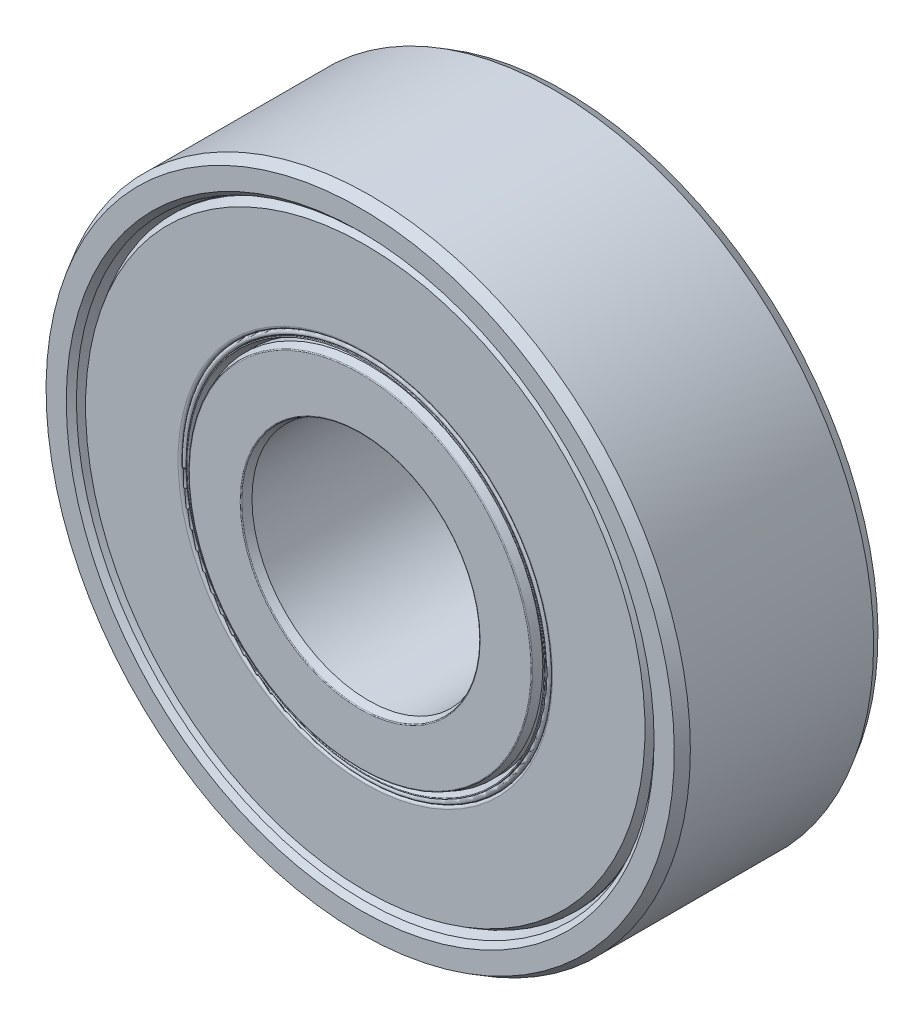
ISO-10303-21;
HEADER;
FILE_DESCRIPTION(('STEP AP214'),'2;1');
FILE_NAME('part.step','',(''),(''),'','','');
FILE_SCHEMA(('AUTOMOTIVE_DESIGN { 1 0 10303 214 1 1 1 1 }'));
ENDSEC;
DATA;
#1=APPLICATION_CONTEXT('core data for automotive mechanical design processes');
#2=APPLICATION_PROTOCOL_DEFINITION('international standard','automotive_design',2000,#1);
#3=PRODUCT_CONTEXT('',#1,'mechanical');
#4=PRODUCT('Part','Part','',(#3));
#5=PRODUCT_RELATED_PRODUCT_CATEGORY('part','',(#4));
#6=PRODUCT_DEFINITION_FORMATION('','',#4);
#7=PRODUCT_DEFINITION_CONTEXT('part definition',#1,'design');
#8=PRODUCT_DEFINITION('design','',#6,#7);
#9=PRODUCT_DEFINITION_SHAPE('','',#8);
#10=(LENGTH_UNIT() NAMED_UNIT(*) SI_UNIT(.MILLI.,.METRE.));
#11=(NAMED_UNIT(*) PLANE_ANGLE_UNIT() SI_UNIT($,.RADIAN.));
#12=(NAMED_UNIT(*) SI_UNIT($,.STERADIAN.) SOLID_ANGLE_UNIT());
#13=UNCERTAINTY_MEASURE_WITH_UNIT(LENGTH_MEASURE(1.E-05),#10,'distance_accuracy_value','');
#14=(GEOMETRIC_REPRESENTATION_CONTEXT(3) GLOBAL_UNCERTAINTY_ASSIGNED_CONTEXT((#13)) GLOBAL_UNIT_ASSIGNED_CONTEXT((#10,
#11,#12)) REPRESENTATION_CONTEXT('',''));
#15=CARTESIAN_POINT('',(0.,0.,0.));
#16=DIRECTION('',(0.,0.,1.));
#17=DIRECTION('',(1.,0.,0.));
#18=AXIS2_PLACEMENT_3D('',#15,#16,#17);
#19=CARTESIAN_POINT('',(0.,0.,3.5));
#20=DIRECTION('',(0.,0.,1.));
#21=DIRECTION('',(0.,-1.,0.));
#22=AXIS2_PLACEMENT_3D('',#19,#20,#21);
#23=CYLINDRICAL_SURFACE('',#22,6.34803966942149);
#24=CARTESIAN_POINT('',(0.,0.,-2.50098016528926));
#25=DIRECTION('',(0.,0.,1.));
#26=DIRECTION('',(0.,-1.,0.));
#27=AXIS2_PLACEMENT_3D('',#24,#25,#26);
#28=CIRCLE('',#27,6.34803966942149);
#29=CARTESIAN_POINT('',(0.,-6.34803966942148,-2.50098016528926));
#30=VERTEX_POINT('',#29);
#31=EDGE_CURVE('E11',#30,#30,#28,.T.);
#32=ORIENTED_EDGE('',*,*,#31,.F.);
#33=EDGE_LOOP('',(#32));
#34=FACE_BOUND('',#33,.T.);
#35=CARTESIAN_POINT('',(0.,0.,-3.2375));
#36=DIRECTION('',(0.,0.,1.));
#37=DIRECTION('',(0.,-1.,0.));
#38=AXIS2_PLACEMENT_3D('',#35,#36,#37);
#39=CIRCLE('',#38,6.34803966942149);
#40=CARTESIAN_POINT('',(0.,-6.34803966942149,-3.2375));
#41=VERTEX_POINT('',#40);
#42=EDGE_CURVE('E71',#41,#41,#39,.T.);
#43=ORIENTED_EDGE('',*,*,#42,.T.);
#44=EDGE_LOOP('',(#43));
#45=FACE_BOUND('',#44,.T.);
#46=ADVANCED_FACE('F46',(#34,#45),#23,.T.);
#47=CARTESIAN_POINT('',(0.,6.34803966942149,-2.50098016528926));
#48=DIRECTION('',(0.,0.,-1.));
#49=DIRECTION('',(0.,1.,0.));
#50=AXIS2_PLACEMENT_3D('',#47,#48,#49);
#51=PLANE('',#50);
#52=CARTESIAN_POINT('',(0.,0.,-2.50098016528926));
#53=DIRECTION('',(0.,0.,1.));
#54=DIRECTION('',(0.,-1.,0.));
#55=AXIS2_PLACEMENT_3D('',#52,#53,#54);
#56=CIRCLE('',#55,5.99803966942149);
#57=CARTESIAN_POINT('',(0.,-5.99803966942149,-2.50098016528926));
#58=VERTEX_POINT('',#57);
#59=EDGE_CURVE('E52',#58,#58,#56,.T.);
#60=ORIENTED_EDGE('',*,*,#59,.F.);
#61=EDGE_LOOP('',(#60));
#62=FACE_BOUND('',#61,.T.);
#63=ORIENTED_EDGE('',*,*,#31,.T.);
#64=EDGE_LOOP('',(#63));
#65=FACE_BOUND('',#64,.T.);
#66=ADVANCED_FACE('F102',(#62,#65),#51,.F.);
#67=CARTESIAN_POINT('',(0.,0.,3.5));
#68=DIRECTION('',(0.,0.,1.));
#69=DIRECTION('',(0.,-1.,0.));
#70=AXIS2_PLACEMENT_3D('',#67,#68,#69);
#71=CYLINDRICAL_SURFACE('',#70,5.99803966942149);
#72=CARTESIAN_POINT('',(0.,0.,-2.92593888343875));
#73=DIRECTION('',(0.,0.,1.));
#74=DIRECTION('',(0.,-1.,0.));
#75=AXIS2_PLACEMENT_3D('',#72,#73,#74);
#76=CIRCLE('',#75,5.99803966942149);
#77=CARTESIAN_POINT('',(0.,-5.99803966942149,-2.92593888343875));
#78=VERTEX_POINT('',#77);
#79=EDGE_CURVE('E56',#78,#78,#76,.T.);
#80=ORIENTED_EDGE('',*,*,#79,.F.);
#81=EDGE_LOOP('',(#80));
#82=FACE_BOUND('',#81,.T.);
#83=ORIENTED_EDGE('',*,*,#59,.T.);
#84=EDGE_LOOP('',(#83));
#85=FACE_BOUND('',#84,.T.);
#86=ADVANCED_FACE('F97',(#82,#85),#71,.F.);
#87=CARTESIAN_POINT('',(0.,0.,-2.92593888343875));
#88=DIRECTION('',(0.,0.,-1.));
#89=DIRECTION('',(0.,1.,0.));
#90=AXIS2_PLACEMENT_3D('',#87,#88,#89);
#91=CONICAL_SURFACE('',#90,5.99803966942149,0.349065850398868);
#92=CARTESIAN_POINT('',(0.,0.,-3.3134853525082));
#93=DIRECTION('',(0.,0.,1.));
#94=DIRECTION('',(0.,-1.,0.));
#95=AXIS2_PLACEMENT_3D('',#92,#93,#94);
#96=CIRCLE('',#95,6.13909504855773);
#97=CARTESIAN_POINT('',(0.,-6.13909504855773,-3.3134853525082));
#98=VERTEX_POINT('',#97);
#99=EDGE_CURVE('E60',#98,#98,#96,.T.);
#100=ORIENTED_EDGE('',*,*,#99,.F.);
#101=EDGE_LOOP('',(#100));
#102=FACE_BOUND('',#101,.T.);
#103=ORIENTED_EDGE('',*,*,#79,.T.);
#104=EDGE_LOOP('',(#103));
#105=FACE_BOUND('',#104,.T.);
#106=ADVANCED_FACE('F91',(#102,#105),#91,.F.);
#107=CARTESIAN_POINT('',(0.,0.,-3.3075));
#108=DIRECTION('',(0.,0.,1.));
#109=DIRECTION('',(0.,-1.,0.));
#110=AXIS2_PLACEMENT_3D('',#107,#108,#109);
#111=TOROIDAL_SURFACE('',#110,6.15553966942149,0.0174999999999998);
#112=CARTESIAN_POINT('',(0.,0.,-3.3075));
#113=DIRECTION('',(0.,0.,1.));
#114=DIRECTION('',(0.,-1.,0.));
#115=AXIS2_PLACEMENT_3D('',#112,#113,#114);
#116=CIRCLE('',#115,6.17303966942149);
#117=CARTESIAN_POINT('',(0.,-6.17303966942149,-3.3075));
#118=VERTEX_POINT('',#117);
#119=EDGE_CURVE('E65',#118,#118,#116,.T.);
#120=ORIENTED_EDGE('',*,*,#119,.F.);
#121=EDGE_LOOP('',(#120));
#122=FACE_BOUND('',#121,.T.);
#123=ORIENTED_EDGE('',*,*,#99,.T.);
#124=EDGE_LOOP('',(#123));
#125=FACE_BOUND('',#124,.T.);
#126=ADVANCED_FACE('F85',(#122,#125),#111,.T.);
#127=CARTESIAN_POINT('',(0.,0.,3.5));
#128=DIRECTION('',(0.,0.,1.));
#129=DIRECTION('',(0.,-1.,0.));
#130=AXIS2_PLACEMENT_3D('',#127,#128,#129);
#131=CYLINDRICAL_SURFACE('',#130,6.17303966942149);
#132=CARTESIAN_POINT('',(0.,0.,-3.2375));
#133=DIRECTION('',(0.,0.,1.));
#134=DIRECTION('',(0.,-1.,0.));
#135=AXIS2_PLACEMENT_3D('',#132,#133,#134);
#136=CIRCLE('',#135,6.17303966942149);
#137=CARTESIAN_POINT('',(0.,-6.17303966942149,-3.2375));
#138=VERTEX_POINT('',#137);
#139=EDGE_CURVE('E68',#138,#138,#136,.T.);
#140=ORIENTED_EDGE('',*,*,#139,.F.);
#141=EDGE_LOOP('',(#140));
#142=FACE_BOUND('',#141,.T.);
#143=ORIENTED_EDGE('',*,*,#119,.T.);
#144=EDGE_LOOP('',(#143));
#145=FACE_BOUND('',#144,.T.);
#146=ADVANCED_FACE('F79',(#142,#145),#131,.T.);
#147=CARTESIAN_POINT('',(0.,0.,-3.2375));
#148=DIRECTION('',(0.,0.,1.));
#149=DIRECTION('',(0.,-1.,0.));
#150=AXIS2_PLACEMENT_3D('',#147,#148,#149);
#151=TOROIDAL_SURFACE('',#150,6.26053966942149,0.0875000000000008);
#152=ORIENTED_EDGE('',*,*,#42,.F.);
#153=EDGE_LOOP('',(#152));
#154=FACE_BOUND('',#153,.T.);
#155=ORIENTED_EDGE('',*,*,#139,.T.);
#156=EDGE_LOOP('',(#155));
#157=FACE_BOUND('',#156,.T.);
#158=ADVANCED_FACE('F76',(#154,#157),#151,.T.);
#159=CLOSED_SHELL('',(#46,#66,#86,#106,#126,#146,#158));
#160=MANIFOLD_SOLID_BREP('B2',#159);
#161=CARTESIAN_POINT('',(0.,6.34803966942149,2.50098016528926));
#162=DIRECTION('',(0.,0.,1.));
#163=DIRECTION('',(0.,-1.,0.));
#164=AXIS2_PLACEMENT_3D('',#161,#162,#163);
#165=PLANE('',#164);
#166=CARTESIAN_POINT('',(0.,0.,2.50098016528926));
#167=DIRECTION('',(0.,0.,1.));
#168=DIRECTION('',(0.,-1.,0.));
#169=AXIS2_PLACEMENT_3D('',#166,#167,#168);
#170=CIRCLE('',#169,6.34803966942149);
#171=CARTESIAN_POINT('',(0.,-6.34803966942149,2.50098016528925));
#172=VERTEX_POINT('',#171);
#173=EDGE_CURVE('E172',#172,#172,#170,.T.);
#174=ORIENTED_EDGE('',*,*,#173,.F.);
#175=EDGE_LOOP('',(#174));
#176=FACE_BOUND('',#175,.T.);
#177=CARTESIAN_POINT('',(0.,0.,2.50098016528926));
#178=DIRECTION('',(0.,0.,1.));
#179=DIRECTION('',(0.,-1.,0.));
#180=AXIS2_PLACEMENT_3D('',#177,#178,#179);
#181=CIRCLE('',#180,5.99803966942149);
#182=CARTESIAN_POINT('',(0.,-5.99803966942149,2.50098016528925));
#183=VERTEX_POINT('',#182);
#184=EDGE_CURVE('E45',#183,#183,#181,.T.);
#185=ORIENTED_EDGE('',*,*,#184,.T.);
#186=EDGE_LOOP('',(#185));
#187=FACE_BOUND('',#186,.T.);
#188=ADVANCED_FACE('F147',(#176,#187),#165,.F.);
#189=CARTESIAN_POINT('',(0.,0.,3.5));
#190=DIRECTION('',(0.,0.,1.));
#191=DIRECTION('',(0.,-1.,0.));
#192=AXIS2_PLACEMENT_3D('',#189,#190,#191);
#193=CYLINDRICAL_SURFACE('',#192,5.99803966942149);
#194=ORIENTED_EDGE('',*,*,#184,.F.);
#195=EDGE_LOOP('',(#194));
#196=FACE_BOUND('',#195,.T.);
#197=CARTESIAN_POINT('',(0.,0.,2.92593888343875));
#198=DIRECTION('',(0.,0.,1.));
#199=DIRECTION('',(0.,-1.,0.));
#200=AXIS2_PLACEMENT_3D('',#197,#198,#199);
#201=CIRCLE('',#200,5.99803966942149);
#202=CARTESIAN_POINT('',(0.,-5.99803966942149,2.92593888343875));
#203=VERTEX_POINT('',#202);
#204=EDGE_CURVE('E153',#203,#203,#201,.T.);
#205=ORIENTED_EDGE('',*,*,#204,.T.);
#206=EDGE_LOOP('',(#205));
#207=FACE_BOUND('',#206,.T.);
#208=ADVANCED_FACE('F179',(#196,#207),#193,.F.);
#209=CARTESIAN_POINT('',(0.,0.,3.3134853525082));
#210=DIRECTION('',(0.,0.,1.));
#211=DIRECTION('',(0.,-1.,0.));
#212=AXIS2_PLACEMENT_3D('',#209,#210,#211);
#213=CONICAL_SURFACE('',#212,6.13909504855773,0.349065850398868);
#214=ORIENTED_EDGE('',*,*,#204,.F.);
#215=EDGE_LOOP('',(#214));
#216=FACE_BOUND('',#215,.T.);
#217=CARTESIAN_POINT('',(0.,0.,3.3134853525082));
#218=DIRECTION('',(0.,0.,1.));
#219=DIRECTION('',(0.,-1.,0.));
#220=AXIS2_PLACEMENT_3D('',#217,#218,#219);
#221=CIRCLE('',#220,6.13909504855773);
#222=CARTESIAN_POINT('',(0.,-6.13909504855773,3.3134853525082));
#223=VERTEX_POINT('',#222);
#224=EDGE_CURVE('E157',#223,#223,#221,.T.);
#225=ORIENTED_EDGE('',*,*,#224,.T.);
#226=EDGE_LOOP('',(#225));
#227=FACE_BOUND('',#226,.T.);
#228=ADVANCED_FACE('F183',(#216,#227),#213,.F.);
#229=CARTESIAN_POINT('',(0.,0.,3.3075));
#230=DIRECTION('',(0.,0.,1.));
#231=DIRECTION('',(0.,-1.,0.));
#232=AXIS2_PLACEMENT_3D('',#229,#230,#231);
#233=TOROIDAL_SURFACE('',#232,6.15553966942149,0.0174999999999998);
#234=ORIENTED_EDGE('',*,*,#224,.F.);
#235=EDGE_LOOP('',(#234));
#236=FACE_BOUND('',#235,.T.);
#237=CARTESIAN_POINT('',(0.,0.,3.3075));
#238=DIRECTION('',(0.,0.,1.));
#239=DIRECTION('',(0.,-1.,0.));
#240=AXIS2_PLACEMENT_3D('',#237,#238,#239);
#241=CIRCLE('',#240,6.17303966942149);
#242=CARTESIAN_POINT('',(0.,-6.17303966942149,3.3075));
#243=VERTEX_POINT('',#242);
#244=EDGE_CURVE('E161',#243,#243,#241,.T.);
#245=ORIENTED_EDGE('',*,*,#244,.T.);
#246=EDGE_LOOP('',(#245));
#247=FACE_BOUND('',#246,.T.);
#248=ADVANCED_FACE('F188',(#236,#247),#233,.T.);
#249=CARTESIAN_POINT('',(0.,0.,3.5));
#250=DIRECTION('',(0.,0.,1.));
#251=DIRECTION('',(0.,-1.,0.));
#252=AXIS2_PLACEMENT_3D('',#249,#250,#251);
#253=CYLINDRICAL_SURFACE('',#252,6.17303966942149);
#254=ORIENTED_EDGE('',*,*,#244,.F.);
#255=EDGE_LOOP('',(#254));
#256=FACE_BOUND('',#255,.T.);
#257=CARTESIAN_POINT('',(0.,0.,3.2375));
#258=DIRECTION('',(0.,0.,1.));
#259=DIRECTION('',(0.,-1.,0.));
#260=AXIS2_PLACEMENT_3D('',#257,#258,#259);
#261=CIRCLE('',#260,6.17303966942149);
#262=CARTESIAN_POINT('',(0.,-6.17303966942149,3.2375));
#263=VERTEX_POINT('',#262);
#264=EDGE_CURVE('E166',#263,#263,#261,.T.);
#265=ORIENTED_EDGE('',*,*,#264,.T.);
#266=EDGE_LOOP('',(#265));
#267=FACE_BOUND('',#266,.T.);
#268=ADVANCED_FACE('F194',(#256,#267),#253,.T.);
#269=CARTESIAN_POINT('',(0.,0.,3.2375));
#270=DIRECTION('',(0.,0.,1.));
#271=DIRECTION('',(0.,-1.,0.));
#272=AXIS2_PLACEMENT_3D('',#269,#270,#271);
#273=TOROIDAL_SURFACE('',#272,6.26053966942149,0.0875000000000008);
#274=ORIENTED_EDGE('',*,*,#264,.F.);
#275=EDGE_LOOP('',(#274));
#276=FACE_BOUND('',#275,.T.);
#277=CARTESIAN_POINT('',(0.,0.,3.2375));
#278=DIRECTION('',(0.,0.,1.));
#279=DIRECTION('',(0.,-1.,0.));
#280=AXIS2_PLACEMENT_3D('',#277,#278,#279);
#281=CIRCLE('',#280,6.34803966942149);
#282=CARTESIAN_POINT('',(0.,-6.34803966942149,3.2375));
#283=VERTEX_POINT('',#282);
#284=EDGE_CURVE('E169',#283,#283,#281,.T.);
#285=ORIENTED_EDGE('',*,*,#284,.T.);
#286=EDGE_LOOP('',(#285));
#287=FACE_BOUND('',#286,.T.);
#288=ADVANCED_FACE('F198',(#276,#287),#273,.T.);
#289=CARTESIAN_POINT('',(0.,0.,3.5));
#290=DIRECTION('',(0.,0.,1.));
#291=DIRECTION('',(0.,-1.,0.));
#292=AXIS2_PLACEMENT_3D('',#289,#290,#291);
#293=CYLINDRICAL_SURFACE('',#292,6.34803966942149);
#294=ORIENTED_EDGE('',*,*,#284,.F.);
#295=EDGE_LOOP('',(#294));
#296=FACE_BOUND('',#295,.T.);
#297=ORIENTED_EDGE('',*,*,#173,.T.);
#298=EDGE_LOOP('',(#297));
#299=FACE_BOUND('',#298,.T.);
#300=ADVANCED_FACE('F176',(#296,#299),#293,.T.);
#301=CLOSED_SHELL('',(#188,#208,#228,#248,#268,#288,#300));
#302=MANIFOLD_SOLID_BREP('B6',#301);
#303=CARTESIAN_POINT('',(0.,0.,-3.325));
#304=DIRECTION('',(0.,0.,1.));
#305=DIRECTION('',(0.,-1.,0.));
#306=AXIS2_PLACEMENT_3D('',#303,#304,#305);
#307=CONICAL_SURFACE('',#306,9.615,0.52359877559829);
#308=CARTESIAN_POINT('',(0.,0.,-3.02189110867545));
#309=DIRECTION('',(0.,0.,1.));
#310=DIRECTION('',(0.,-1.,0.));
#311=AXIS2_PLACEMENT_3D('',#308,#309,#310);
#312=CIRCLE('',#311,9.79);
#313=CARTESIAN_POINT('',(0.,-9.79,-3.02189110867545));
#314=VERTEX_POINT('',#313);
#315=EDGE_CURVE('E270',#314,#314,#312,.T.);
#316=ORIENTED_EDGE('',*,*,#315,.F.);
#317=EDGE_LOOP('',(#316));
#318=FACE_BOUND('',#317,.T.);
#319=CARTESIAN_POINT('',(0.,0.,-3.325));
#320=DIRECTION('',(0.,0.,1.));
#321=DIRECTION('',(0.,-1.,0.));
#322=AXIS2_PLACEMENT_3D('',#319,#320,#321);
#323=CIRCLE('',#322,9.615);
#324=CARTESIAN_POINT('',(0.,-9.615,-3.32500000000001));
#325=VERTEX_POINT('',#324);
#326=EDGE_CURVE('E146',#325,#325,#323,.T.);
#327=ORIENTED_EDGE('',*,*,#326,.T.);
#328=EDGE_LOOP('',(#327));
#329=FACE_BOUND('',#328,.T.);
#330=ADVANCED_FACE('F248',(#318,#329),#307,.T.);
#331=CARTESIAN_POINT('',(0.,9.615,-3.325));
#332=DIRECTION('',(0.,0.,1.));
#333=DIRECTION('',(0.,-1.,0.));
#334=AXIS2_PLACEMENT_3D('',#331,#332,#333);
#335=PLANE('',#334);
#336=ORIENTED_EDGE('',*,*,#326,.F.);
#337=EDGE_LOOP('',(#336));
#338=FACE_BOUND('',#337,.T.);
#339=CARTESIAN_POINT('',(0.,0.,-3.325));
#340=DIRECTION('',(0.,0.,1.));
#341=DIRECTION('',(0.,-1.,0.));
#342=AXIS2_PLACEMENT_3D('',#339,#340,#341);
#343=CIRCLE('',#342,6.43553966942149);
#344=CARTESIAN_POINT('',(0.,-6.43553966942149,-3.32500000000001));
#345=VERTEX_POINT('',#344);
#346=EDGE_CURVE('E254',#345,#345,#343,.T.);
#347=ORIENTED_EDGE('',*,*,#346,.T.);
#348=EDGE_LOOP('',(#347));
#349=FACE_BOUND('',#348,.T.);
#350=ADVANCED_FACE('F277',(#338,#349),#335,.F.);
#351=CARTESIAN_POINT('',(0.,0.,-3.2375));
#352=DIRECTION('',(0.,0.,1.));
#353=DIRECTION('',(0.,-1.,0.));
#354=AXIS2_PLACEMENT_3D('',#351,#352,#353);
#355=TOROIDAL_SURFACE('',#354,6.43553966942149,0.0874999999999997);
#356=ORIENTED_EDGE('',*,*,#346,.F.);
#357=EDGE_LOOP('',(#356));
#358=FACE_BOUND('',#357,.T.);
#359=CARTESIAN_POINT('',(0.,0.,-3.2375));
#360=DIRECTION('',(0.,0.,1.));
#361=DIRECTION('',(0.,-1.,0.));
#362=AXIS2_PLACEMENT_3D('',#359,#360,#361);
#363=CIRCLE('',#362,6.34803966942149);
#364=CARTESIAN_POINT('',(0.,-6.34803966942149,-3.2375));
#365=VERTEX_POINT('',#364);
#366=EDGE_CURVE('E258',#365,#365,#363,.T.);
#367=ORIENTED_EDGE('',*,*,#366,.T.);
#368=EDGE_LOOP('',(#367));
#369=FACE_BOUND('',#368,.T.);
#370=ADVANCED_FACE('F281',(#358,#369),#355,.T.);
#371=CARTESIAN_POINT('',(0.,0.,3.5));
#372=DIRECTION('',(0.,0.,1.));
#373=DIRECTION('',(0.,-1.,0.));
#374=AXIS2_PLACEMENT_3D('',#371,#372,#373);
#375=CYLINDRICAL_SURFACE('',#374,6.34803966942149);
#376=ORIENTED_EDGE('',*,*,#366,.F.);
#377=EDGE_LOOP('',(#376));
#378=FACE_BOUND('',#377,.T.);
#379=CARTESIAN_POINT('',(0.,0.,-2.50098016528926));
#380=DIRECTION('',(0.,0.,1.));
#381=DIRECTION('',(0.,-1.,0.));
#382=AXIS2_PLACEMENT_3D('',#379,#380,#381);
#383=CIRCLE('',#382,6.34803966942149);
#384=CARTESIAN_POINT('',(0.,-6.34803966942149,-2.50098016528926));
#385=VERTEX_POINT('',#384);
#386=EDGE_CURVE('E262',#385,#385,#383,.T.);
#387=ORIENTED_EDGE('',*,*,#386,.T.);
#388=EDGE_LOOP('',(#387));
#389=FACE_BOUND('',#388,.T.);
#390=ADVANCED_FACE('F286',(#378,#389),#375,.F.);
#391=CARTESIAN_POINT('',(0.,9.79,-2.50098016528926));
#392=DIRECTION('',(0.,0.,-1.));
#393=DIRECTION('',(0.,1.,0.));
#394=AXIS2_PLACEMENT_3D('',#391,#392,#393);
#395=PLANE('',#394);
#396=ORIENTED_EDGE('',*,*,#386,.F.);
#397=EDGE_LOOP('',(#396));
#398=FACE_BOUND('',#397,.T.);
#399=CARTESIAN_POINT('',(0.,0.,-2.50098016528926));
#400=DIRECTION('',(0.,0.,1.));
#401=DIRECTION('',(0.,-1.,0.));
#402=AXIS2_PLACEMENT_3D('',#399,#400,#401);
#403=CIRCLE('',#402,9.79);
#404=CARTESIAN_POINT('',(0.,-9.79,-2.50098016528926));
#405=VERTEX_POINT('',#404);
#406=EDGE_CURVE('E267',#405,#405,#403,.T.);
#407=ORIENTED_EDGE('',*,*,#406,.T.);
#408=EDGE_LOOP('',(#407));
#409=FACE_BOUND('',#408,.T.);
#410=ADVANCED_FACE('F292',(#398,#409),#395,.F.);
#411=CARTESIAN_POINT('',(0.,0.,3.5));
#412=DIRECTION('',(0.,0.,1.));
#413=DIRECTION('',(0.,-1.,0.));
#414=AXIS2_PLACEMENT_3D('',#411,#412,#413);
#415=CYLINDRICAL_SURFACE('',#414,9.79);
#416=ORIENTED_EDGE('',*,*,#406,.F.);
#417=EDGE_LOOP('',(#416));
#418=FACE_BOUND('',#417,.T.);
#419=ORIENTED_EDGE('',*,*,#315,.T.);
#420=EDGE_LOOP('',(#419));
#421=FACE_BOUND('',#420,.T.);
#422=ADVANCED_FACE('F274',(#418,#421),#415,.T.);
#423=CLOSED_SHELL('',(#330,#350,#370,#390,#410,#422));
#424=MANIFOLD_SOLID_BREP('B40',#423);
#425=CARTESIAN_POINT('',(0.,9.79,2.50098016528926));
#426=DIRECTION('',(0.,0.,1.));
#427=DIRECTION('',(0.,-1.,0.));
#428=AXIS2_PLACEMENT_3D('',#425,#426,#427);
#429=PLANE('',#428);
#430=CARTESIAN_POINT('',(0.,0.,2.50098016528925));
#431=DIRECTION('',(0.,0.,1.));
#432=DIRECTION('',(0.,-1.,0.));
#433=AXIS2_PLACEMENT_3D('',#430,#431,#432);
#434=CIRCLE('',#433,9.79);
#435=CARTESIAN_POINT('',(0.,-9.79,2.50098016528925));
#436=VERTEX_POINT('',#435);
#437=EDGE_CURVE('E247',#436,#436,#434,.T.);
#438=ORIENTED_EDGE('',*,*,#437,.F.);
#439=EDGE_LOOP('',(#438));
#440=FACE_BOUND('',#439,.T.);
#441=CARTESIAN_POINT('',(0.,0.,2.50098016528926));
#442=DIRECTION('',(0.,0.,1.));
#443=DIRECTION('',(0.,-1.,0.));
#444=AXIS2_PLACEMENT_3D('',#441,#442,#443);
#445=CIRCLE('',#444,6.34803966942149);
#446=CARTESIAN_POINT('',(0.,-6.34803966942149,2.50098016528925));
#447=VERTEX_POINT('',#446);
#448=EDGE_CURVE('E356',#447,#447,#445,.T.);
#449=ORIENTED_EDGE('',*,*,#448,.T.);
#450=EDGE_LOOP('',(#449));
#451=FACE_BOUND('',#450,.T.);
#452=ADVANCED_FACE('F334',(#440,#451),#429,.F.);
#453=CARTESIAN_POINT('',(0.,0.,3.5));
#454=DIRECTION('',(0.,0.,1.));
#455=DIRECTION('',(0.,-1.,0.));
#456=AXIS2_PLACEMENT_3D('',#453,#454,#455);
#457=CYLINDRICAL_SURFACE('',#456,9.79);
#458=CARTESIAN_POINT('',(0.,0.,3.02189110867544));
#459=DIRECTION('',(0.,0.,1.));
#460=DIRECTION('',(0.,-1.,0.));
#461=AXIS2_PLACEMENT_3D('',#458,#459,#460);
#462=CIRCLE('',#461,9.79);
#463=CARTESIAN_POINT('',(0.,-9.79,3.02189110867544));
#464=VERTEX_POINT('',#463);
#465=EDGE_CURVE('E340',#464,#464,#462,.T.);
#466=ORIENTED_EDGE('',*,*,#465,.F.);
#467=EDGE_LOOP('',(#466));
#468=FACE_BOUND('',#467,.T.);
#469=ORIENTED_EDGE('',*,*,#437,.T.);
#470=EDGE_LOOP('',(#469));
#471=FACE_BOUND('',#470,.T.);
#472=ADVANCED_FACE('F381',(#468,#471),#457,.T.);
#473=CARTESIAN_POINT('',(0.,0.,3.02189110867544));
#474=DIRECTION('',(0.,0.,-1.));
#475=DIRECTION('',(0.,1.,0.));
#476=AXIS2_PLACEMENT_3D('',#473,#474,#475);
#477=CONICAL_SURFACE('',#476,9.79,0.52359877559829);
#478=CARTESIAN_POINT('',(0.,0.,3.325));
#479=DIRECTION('',(0.,0.,1.));
#480=DIRECTION('',(0.,-1.,0.));
#481=AXIS2_PLACEMENT_3D('',#478,#479,#480);
#482=CIRCLE('',#481,9.615);
#483=CARTESIAN_POINT('',(0.,-9.615,3.325));
#484=VERTEX_POINT('',#483);
#485=EDGE_CURVE('E344',#484,#484,#482,.T.);
#486=ORIENTED_EDGE('',*,*,#485,.F.);
#487=EDGE_LOOP('',(#486));
#488=FACE_BOUND('',#487,.T.);
#489=ORIENTED_EDGE('',*,*,#465,.T.);
#490=EDGE_LOOP('',(#489));
#491=FACE_BOUND('',#490,.T.);
#492=ADVANCED_FACE('F376',(#488,#491),#477,.T.);
#493=CARTESIAN_POINT('',(0.,9.615,3.325));
#494=DIRECTION('',(0.,0.,-1.));
#495=DIRECTION('',(0.,1.,0.));
#496=AXIS2_PLACEMENT_3D('',#493,#494,#495);
#497=PLANE('',#496);
#498=CARTESIAN_POINT('',(0.,0.,3.325));
#499=DIRECTION('',(0.,0.,1.));
#500=DIRECTION('',(0.,-1.,0.));
#501=AXIS2_PLACEMENT_3D('',#498,#499,#500);
#502=CIRCLE('',#501,6.43553966942149);
#503=CARTESIAN_POINT('',(0.,-6.43553966942149,3.325));
#504=VERTEX_POINT('',#503);
#505=EDGE_CURVE('E348',#504,#504,#502,.T.);
#506=ORIENTED_EDGE('',*,*,#505,.F.);
#507=EDGE_LOOP('',(#506));
#508=FACE_BOUND('',#507,.T.);
#509=ORIENTED_EDGE('',*,*,#485,.T.);
#510=EDGE_LOOP('',(#509));
#511=FACE_BOUND('',#510,.T.);
#512=ADVANCED_FACE('F370',(#508,#511),#497,.F.);
#513=CARTESIAN_POINT('',(0.,0.,3.2375));
#514=DIRECTION('',(0.,0.,1.));
#515=DIRECTION('',(0.,-1.,0.));
#516=AXIS2_PLACEMENT_3D('',#513,#514,#515);
#517=TOROIDAL_SURFACE('',#516,6.43553966942149,0.0874999999999997);
#518=CARTESIAN_POINT('',(0.,0.,3.2375));
#519=DIRECTION('',(0.,0.,1.));
#520=DIRECTION('',(0.,-1.,0.));
#521=AXIS2_PLACEMENT_3D('',#518,#519,#520);
#522=CIRCLE('',#521,6.34803966942149);
#523=CARTESIAN_POINT('',(0.,-6.34803966942149,3.2375));
#524=VERTEX_POINT('',#523);
#525=EDGE_CURVE('E353',#524,#524,#522,.T.);
#526=ORIENTED_EDGE('',*,*,#525,.F.);
#527=EDGE_LOOP('',(#526));
#528=FACE_BOUND('',#527,.T.);
#529=ORIENTED_EDGE('',*,*,#505,.T.);
#530=EDGE_LOOP('',(#529));
#531=FACE_BOUND('',#530,.T.);
#532=ADVANCED_FACE('F364',(#528,#531),#517,.T.);
#533=CARTESIAN_POINT('',(0.,0.,3.5));
#534=DIRECTION('',(0.,0.,1.));
#535=DIRECTION('',(0.,-1.,0.));
#536=AXIS2_PLACEMENT_3D('',#533,#534,#535);
#537=CYLINDRICAL_SURFACE('',#536,6.34803966942149);
#538=ORIENTED_EDGE('',*,*,#448,.F.);
#539=EDGE_LOOP('',(#538));
#540=FACE_BOUND('',#539,.T.);
#541=ORIENTED_EDGE('',*,*,#525,.T.);
#542=EDGE_LOOP('',(#541));
#543=FACE_BOUND('',#542,.T.);
#544=ADVANCED_FACE('F361',(#540,#543),#537,.F.);
#545=CLOSED_SHELL('',(#452,#472,#492,#512,#532,#544));
#546=MANIFOLD_SOLID_BREP('B141',#545);
#547=CARTESIAN_POINT('',(-6.17179323000387,4.92184086261279,0.));
#548=DIRECTION('',(0.,0.,1.));
#549=DIRECTION('',(-0.781831482468022,0.623489801858743,0.));
#550=AXIS2_PLACEMENT_3D('',#547,#548,#549);
#551=SPHERICAL_SURFACE('',#550,2.50098016528926);
#552=CARTESIAN_POINT('',(-6.17179323000387,4.92184086261279,2.50098016528925));
#553=VERTEX_POINT('',#552);
#554=VERTEX_LOOP('',#553);
#555=FACE_BOUND('',#554,.T.);
#556=ADVANCED_FACE('F438',(#555),#551,.T.);
#557=CLOSED_SHELL('',(#556));
#558=MANIFOLD_SOLID_BREP('B242',#557);
#559=CARTESIAN_POINT('',(-7.69610027617647,-1.75658466628943,0.));
#560=DIRECTION('',(0.,0.,1.));
#561=DIRECTION('',(-0.974927912181826,-0.222520933956305,0.));
#562=AXIS2_PLACEMENT_3D('',#559,#560,#561);
#563=SPHERICAL_SURFACE('',#562,2.50098016528926);
#564=CARTESIAN_POINT('',(-7.69610027617647,-1.75658466628943,2.50098016528925));
#565=VERTEX_POINT('',#564);
#566=VERTEX_LOOP('',#565);
#567=FACE_BOUND('',#566,.T.);
#568=ADVANCED_FACE('F455',(#567),#563,.T.);
#569=CLOSED_SHELL('',(#568));
#570=MANIFOLD_SOLID_BREP('B330',#569);
#571=CARTESIAN_POINT('',(-3.42508684255252,-7.11226611367855,0.));
#572=DIRECTION('',(0.,0.,1.));
#573=DIRECTION('',(-0.433883739117565,-0.900968867902416,0.));
#574=AXIS2_PLACEMENT_3D('',#571,#572,#573);
#575=SPHERICAL_SURFACE('',#574,2.50098016528926);
#576=CARTESIAN_POINT('',(-3.42508684255252,-7.11226611367855,2.50098016528925));
#577=VERTEX_POINT('',#576);
#578=VERTEX_LOOP('',#577);
#579=FACE_BOUND('',#578,.T.);
#580=ADVANCED_FACE('F472',(#579),#575,.T.);
#581=CLOSED_SHELL('',(#580));
#582=MANIFOLD_SOLID_BREP('B434',#581);
#583=CARTESIAN_POINT('',(3.42508684255242,-7.1122661136786,0.));
#584=DIRECTION('',(0.,0.,1.));
#585=DIRECTION('',(0.433883739117553,-0.900968867902422,0.));
#586=AXIS2_PLACEMENT_3D('',#583,#584,#585);
#587=SPHERICAL_SURFACE('',#586,2.50098016528926);
#588=CARTESIAN_POINT('',(3.42508684255242,-7.1122661136786,2.50098016528925));
#589=VERTEX_POINT('',#588);
#590=VERTEX_LOOP('',#589);
#591=FACE_BOUND('',#590,.T.);
#592=ADVANCED_FACE('F489',(#591),#587,.T.);
#593=CLOSED_SHELL('',(#592));
#594=MANIFOLD_SOLID_BREP('B451',#593);
#595=CARTESIAN_POINT('',(7.69610027617644,-1.75658466628954,0.));
#596=DIRECTION('',(0.,0.,1.));
#597=DIRECTION('',(0.974927912181823,-0.222520933956318,0.));
#598=AXIS2_PLACEMENT_3D('',#595,#596,#597);
#599=SPHERICAL_SURFACE('',#598,2.50098016528926);
#600=CARTESIAN_POINT('',(7.69610027617644,-1.75658466628954,2.50098016528925));
#601=VERTEX_POINT('',#600);
#602=VERTEX_LOOP('',#601);
#603=FACE_BOUND('',#602,.T.);
#604=ADVANCED_FACE('F506',(#603),#599,.T.);
#605=CLOSED_SHELL('',(#604));
#606=MANIFOLD_SOLID_BREP('B468',#605);
#607=CARTESIAN_POINT('',(6.17179323000394,4.9218408626127,0.));
#608=DIRECTION('',(0.,0.,1.));
#609=DIRECTION('',(0.781831482468031,0.623489801858732,0.));
#610=AXIS2_PLACEMENT_3D('',#607,#608,#609);
#611=SPHERICAL_SURFACE('',#610,2.50098016528926);
#612=CARTESIAN_POINT('',(6.17179323000394,4.9218408626127,2.50098016528925));
#613=VERTEX_POINT('',#612);
#614=VERTEX_LOOP('',#613);
#615=FACE_BOUND('',#614,.T.);
#616=ADVANCED_FACE('F523',(#615),#611,.T.);
#617=CLOSED_SHELL('',(#616));
#618=MANIFOLD_SOLID_BREP('B485',#617);
#619=CARTESIAN_POINT('',(0.,7.89401983471074,0.));
#620=DIRECTION('',(0.,0.,1.));
#621=DIRECTION('',(0.,1.,0.));
#622=AXIS2_PLACEMENT_3D('',#619,#620,#621);
#623=SPHERICAL_SURFACE('',#622,2.50098016528926);
#624=CARTESIAN_POINT('',(0.,7.89401983471074,2.50098016528926));
#625=VERTEX_POINT('',#624);
#626=VERTEX_LOOP('',#625);
#627=FACE_BOUND('',#626,.T.);
#628=ADVANCED_FACE('F542',(#627),#623,.T.);
#629=CLOSED_SHELL('',(#628));
#630=MANIFOLD_SOLID_BREP('B502',#629);
#631=CARTESIAN_POINT('',(0.,0.,-3.465));
#632=DIRECTION('',(0.,0.,1.));
#633=DIRECTION('',(0.,-1.,0.));
#634=AXIS2_PLACEMENT_3D('',#631,#632,#633);
#635=TOROIDAL_SURFACE('',#634,4.12641892943188,0.0349999999999996);
#636=CARTESIAN_POINT('',(0.,0.,-3.5));
#637=DIRECTION('',(0.,0.,1.));
#638=DIRECTION('',(0.,-1.,0.));
#639=AXIS2_PLACEMENT_3D('',#636,#637,#638);
#640=CIRCLE('',#639,4.12641892943188);
#641=CARTESIAN_POINT('',(0.,-4.12641892943187,-3.5));
#642=VERTEX_POINT('',#641);
#643=EDGE_CURVE('E541',#642,#642,#640,.T.);
#644=ORIENTED_EDGE('',*,*,#643,.F.);
#645=EDGE_LOOP('',(#644));
#646=FACE_BOUND('',#645,.T.);
#647=CARTESIAN_POINT('',(0.,0.,-3.4769707050164));
#648=DIRECTION('',(0.,0.,1.));
#649=DIRECTION('',(0.,-1.,0.));
#650=AXIS2_PLACEMENT_3D('',#647,#648,#649);
#651=CIRCLE('',#650,4.09352968770437);
#652=CARTESIAN_POINT('',(0.,-4.09352968770437,-3.4769707050164));
#653=VERTEX_POINT('',#652);
#654=EDGE_CURVE('E606',#653,#653,#651,.T.);
#655=ORIENTED_EDGE('',*,*,#654,.T.);
#656=EDGE_LOOP('',(#655));
#657=FACE_BOUND('',#656,.T.);
#658=ADVANCED_FACE('F560',(#646,#657),#635,.T.);
#659=CARTESIAN_POINT('',(0.,4.12641892943188,-3.5));
#660=DIRECTION('',(0.,0.,1.));
#661=DIRECTION('',(0.,-1.,0.));
#662=AXIS2_PLACEMENT_3D('',#659,#660,#661);
#663=PLANE('',#662);
#664=CARTESIAN_POINT('',(0.,0.,-3.5));
#665=DIRECTION('',(0.,0.,1.));
#666=DIRECTION('',(0.,-1.,0.));
#667=AXIS2_PLACEMENT_3D('',#664,#665,#666);
#668=CIRCLE('',#667,5.87162073998961);
#669=CARTESIAN_POINT('',(0.,-5.87162073998961,-3.5));
#670=VERTEX_POINT('',#669);
#671=EDGE_CURVE('E566',#670,#670,#668,.T.);
#672=ORIENTED_EDGE('',*,*,#671,.F.);
#673=EDGE_LOOP('',(#672));
#674=FACE_BOUND('',#673,.T.);
#675=ORIENTED_EDGE('',*,*,#643,.T.);
#676=EDGE_LOOP('',(#675));
#677=FACE_BOUND('',#676,.T.);
#678=ADVANCED_FACE('F679',(#674,#677),#663,.F.);
#679=CARTESIAN_POINT('',(0.,0.,-3.465));
#680=DIRECTION('',(0.,0.,1.));
#681=DIRECTION('',(0.,-1.,0.));
#682=AXIS2_PLACEMENT_3D('',#679,#680,#681);
#683=TOROIDAL_SURFACE('',#682,5.87162073998961,0.0349999999999996);
#684=CARTESIAN_POINT('',(0.,0.,-3.4769707050164));
#685=DIRECTION('',(0.,0.,1.));
#686=DIRECTION('',(0.,-1.,0.));
#687=AXIS2_PLACEMENT_3D('',#684,#685,#686);
#688=CIRCLE('',#687,5.90450998171712);
#689=CARTESIAN_POINT('',(0.,-5.90450998171712,-3.4769707050164));
#690=VERTEX_POINT('',#689);
#691=EDGE_CURVE('E570',#690,#690,#688,.T.);
#692=ORIENTED_EDGE('',*,*,#691,.F.);
#693=EDGE_LOOP('',(#692));
#694=FACE_BOUND('',#693,.T.);
#695=ORIENTED_EDGE('',*,*,#671,.T.);
#696=EDGE_LOOP('',(#695));
#697=FACE_BOUND('',#696,.T.);
#698=ADVANCED_FACE('F674',(#694,#697),#683,.T.);
#699=CARTESIAN_POINT('',(0.,0.,-3.4769707050164));
#700=DIRECTION('',(0.,0.,1.));
#701=DIRECTION('',(0.,-1.,0.));
#702=AXIS2_PLACEMENT_3D('',#699,#700,#701);
#703=CONICAL_SURFACE('',#702,5.90450998171712,0.349065850398866);
#704=CARTESIAN_POINT('',(0.,0.,-3.22));
#705=DIRECTION('',(0.,0.,1.));
#706=DIRECTION('',(0.,-1.,0.));
#707=AXIS2_PLACEMENT_3D('',#704,#705,#706);
#708=CIRCLE('',#707,5.99803966942149);
#709=CARTESIAN_POINT('',(0.,-5.99803966942149,-3.22));
#710=VERTEX_POINT('',#709);
#711=EDGE_CURVE('E574',#710,#710,#708,.T.);
#712=ORIENTED_EDGE('',*,*,#711,.F.);
#713=EDGE_LOOP('',(#712));
#714=FACE_BOUND('',#713,.T.);
#715=ORIENTED_EDGE('',*,*,#691,.T.);
#716=EDGE_LOOP('',(#715));
#717=FACE_BOUND('',#716,.T.);
#718=ADVANCED_FACE('F668',(#714,#717),#703,.T.);
#719=CARTESIAN_POINT('',(0.,0.,3.5));
#720=DIRECTION('',(0.,0.,1.));
#721=DIRECTION('',(0.,-1.,0.));
#722=AXIS2_PLACEMENT_3D('',#719,#720,#721);
#723=CYLINDRICAL_SURFACE('',#722,5.99803966942149);
#724=CARTESIAN_POINT('',(0.,0.,-1.631));
#725=DIRECTION('',(0.,0.,1.));
#726=DIRECTION('',(0.,-1.,0.));
#727=AXIS2_PLACEMENT_3D('',#724,#725,#726);
#728=CIRCLE('',#727,5.99803966942149);
#729=CARTESIAN_POINT('',(0.,-5.99803966942148,-1.631));
#730=VERTEX_POINT('',#729);
#731=EDGE_CURVE('E579',#730,#730,#728,.T.);
#732=ORIENTED_EDGE('',*,*,#731,.F.);
#733=EDGE_LOOP('',(#732));
#734=FACE_BOUND('',#733,.T.);
#735=ORIENTED_EDGE('',*,*,#711,.T.);
#736=EDGE_LOOP('',(#735));
#737=FACE_BOUND('',#736,.T.);
#738=ADVANCED_FACE('F662',(#734,#737),#723,.T.);
#739=CARTESIAN_POINT('',(0.,0.,0.));
#740=DIRECTION('',(0.,0.,1.));
#741=DIRECTION('',(0.,-1.,0.));
#742=AXIS2_PLACEMENT_3D('',#739,#740,#741);
#743=TOROIDAL_SURFACE('',#742,7.89401983471074,2.50098016528926);
#744=CARTESIAN_POINT('',(0.,0.,1.631));
#745=DIRECTION('',(0.,0.,1.));
#746=DIRECTION('',(0.,-1.,0.));
#747=AXIS2_PLACEMENT_3D('',#744,#745,#746);
#748=CIRCLE('',#747,5.99803966942149);
#749=CARTESIAN_POINT('',(0.,-5.99803966942149,1.631));
#750=VERTEX_POINT('',#749);
#751=EDGE_CURVE('E582',#750,#750,#748,.T.);
#752=ORIENTED_EDGE('',*,*,#751,.F.);
#753=EDGE_LOOP('',(#752));
#754=FACE_BOUND('',#753,.T.);
#755=ORIENTED_EDGE('',*,*,#731,.T.);
#756=EDGE_LOOP('',(#755));
#757=FACE_BOUND('',#756,.T.);
#758=ADVANCED_FACE('F656',(#754,#757),#743,.F.);
#759=CARTESIAN_POINT('',(0.,0.,3.5));
#760=DIRECTION('',(0.,0.,1.));
#761=DIRECTION('',(0.,-1.,0.));
#762=AXIS2_PLACEMENT_3D('',#759,#760,#761);
#763=CYLINDRICAL_SURFACE('',#762,5.99803966942149);
#764=CARTESIAN_POINT('',(0.,0.,3.22));
#765=DIRECTION('',(0.,0.,1.));
#766=DIRECTION('',(0.,-1.,0.));
#767=AXIS2_PLACEMENT_3D('',#764,#765,#766);
#768=CIRCLE('',#767,5.99803966942149);
#769=CARTESIAN_POINT('',(0.,-5.99803966942149,3.22));
#770=VERTEX_POINT('',#769);
#771=EDGE_CURVE('E585',#770,#770,#768,.T.);
#772=ORIENTED_EDGE('',*,*,#771,.F.);
#773=EDGE_LOOP('',(#772));
#774=FACE_BOUND('',#773,.T.);
#775=ORIENTED_EDGE('',*,*,#751,.T.);
#776=EDGE_LOOP('',(#775));
#777=FACE_BOUND('',#776,.T.);
#778=ADVANCED_FACE('F650',(#774,#777),#763,.T.);
#779=CARTESIAN_POINT('',(0.,0.,3.22));
#780=DIRECTION('',(0.,0.,-1.));
#781=DIRECTION('',(0.,1.,0.));
#782=AXIS2_PLACEMENT_3D('',#779,#780,#781);
#783=CONICAL_SURFACE('',#782,5.99803966942149,0.349065850398867);
#784=CARTESIAN_POINT('',(0.,0.,3.4769707050164));
#785=DIRECTION('',(0.,0.,1.));
#786=DIRECTION('',(0.,-1.,0.));
#787=AXIS2_PLACEMENT_3D('',#784,#785,#786);
#788=CIRCLE('',#787,5.90450998171712);
#789=CARTESIAN_POINT('',(0.,-5.90450998171712,3.4769707050164));
#790=VERTEX_POINT('',#789);
#791=EDGE_CURVE('E588',#790,#790,#788,.T.);
#792=ORIENTED_EDGE('',*,*,#791,.F.);
#793=EDGE_LOOP('',(#792));
#794=FACE_BOUND('',#793,.T.);
#795=ORIENTED_EDGE('',*,*,#771,.T.);
#796=EDGE_LOOP('',(#795));
#797=FACE_BOUND('',#796,.T.);
#798=ADVANCED_FACE('F644',(#794,#797),#783,.T.);
#799=CARTESIAN_POINT('',(0.,0.,3.465));
#800=DIRECTION('',(0.,0.,1.));
#801=DIRECTION('',(0.,-1.,0.));
#802=AXIS2_PLACEMENT_3D('',#799,#800,#801);
#803=TOROIDAL_SURFACE('',#802,5.87162073998961,0.0349999999999996);
#804=CARTESIAN_POINT('',(0.,0.,3.5));
#805=DIRECTION('',(0.,0.,1.));
#806=DIRECTION('',(0.,-1.,0.));
#807=AXIS2_PLACEMENT_3D('',#804,#805,#806);
#808=CIRCLE('',#807,5.87162073998961);
#809=CARTESIAN_POINT('',(0.,-5.87162073998961,3.5));
#810=VERTEX_POINT('',#809);
#811=EDGE_CURVE('E591',#810,#810,#808,.T.);
#812=ORIENTED_EDGE('',*,*,#811,.F.);
#813=EDGE_LOOP('',(#812));
#814=FACE_BOUND('',#813,.T.);
#815=ORIENTED_EDGE('',*,*,#791,.T.);
#816=EDGE_LOOP('',(#815));
#817=FACE_BOUND('',#816,.T.);
#818=ADVANCED_FACE('F638',(#814,#817),#803,.T.);
#819=CARTESIAN_POINT('',(0.,4.12641892943188,3.5));
#820=DIRECTION('',(0.,0.,-1.));
#821=DIRECTION('',(0.,1.,0.));
#822=AXIS2_PLACEMENT_3D('',#819,#820,#821);
#823=PLANE('',#822);
#824=CARTESIAN_POINT('',(0.,0.,3.5));
#825=DIRECTION('',(0.,0.,1.));
#826=DIRECTION('',(0.,-1.,0.));
#827=AXIS2_PLACEMENT_3D('',#824,#825,#826);
#828=CIRCLE('',#827,4.12641892943188);
#829=CARTESIAN_POINT('',(0.,-4.12641892943188,3.5));
#830=VERTEX_POINT('',#829);
#831=EDGE_CURVE('E594',#830,#830,#828,.T.);
#832=ORIENTED_EDGE('',*,*,#831,.F.);
#833=EDGE_LOOP('',(#832));
#834=FACE_BOUND('',#833,.T.);
#835=ORIENTED_EDGE('',*,*,#811,.T.);
#836=EDGE_LOOP('',(#835));
#837=FACE_BOUND('',#836,.T.);
#838=ADVANCED_FACE('F632',(#834,#837),#823,.F.);
#839=CARTESIAN_POINT('',(0.,0.,3.465));
#840=DIRECTION('',(0.,0.,1.));
#841=DIRECTION('',(0.,-1.,0.));
#842=AXIS2_PLACEMENT_3D('',#839,#840,#841);
#843=TOROIDAL_SURFACE('',#842,4.12641892943188,0.0349999999999996);
#844=CARTESIAN_POINT('',(0.,0.,3.4769707050164));
#845=DIRECTION('',(0.,0.,1.));
#846=DIRECTION('',(0.,-1.,0.));
#847=AXIS2_PLACEMENT_3D('',#844,#845,#846);
#848=CIRCLE('',#847,4.09352968770437);
#849=CARTESIAN_POINT('',(0.,-4.09352968770437,3.4769707050164));
#850=VERTEX_POINT('',#849);
#851=EDGE_CURVE('E597',#850,#850,#848,.T.);
#852=ORIENTED_EDGE('',*,*,#851,.F.);
#853=EDGE_LOOP('',(#852));
#854=FACE_BOUND('',#853,.T.);
#855=ORIENTED_EDGE('',*,*,#831,.T.);
#856=EDGE_LOOP('',(#855));
#857=FACE_BOUND('',#856,.T.);
#858=ADVANCED_FACE('F626',(#854,#857),#843,.T.);
#859=CARTESIAN_POINT('',(0.,0.,3.4769707050164));
#860=DIRECTION('',(0.,0.,1.));
#861=DIRECTION('',(0.,-1.,0.));
#862=AXIS2_PLACEMENT_3D('',#859,#860,#861);
#863=CONICAL_SURFACE('',#862,4.09352968770437,0.349065850398867);
#864=CARTESIAN_POINT('',(0.,0.,3.22));
#865=DIRECTION('',(0.,0.,1.));
#866=DIRECTION('',(0.,-1.,0.));
#867=AXIS2_PLACEMENT_3D('',#864,#865,#866);
#868=CIRCLE('',#867,4.);
#869=CARTESIAN_POINT('',(0.,-4.,3.22));
#870=VERTEX_POINT('',#869);
#871=EDGE_CURVE('E600',#870,#870,#868,.T.);
#872=ORIENTED_EDGE('',*,*,#871,.F.);
#873=EDGE_LOOP('',(#872));
#874=FACE_BOUND('',#873,.T.);
#875=ORIENTED_EDGE('',*,*,#851,.T.);
#876=EDGE_LOOP('',(#875));
#877=FACE_BOUND('',#876,.T.);
#878=ADVANCED_FACE('F620',(#874,#877),#863,.F.);
#879=CARTESIAN_POINT('',(0.,0.,3.5));
#880=DIRECTION('',(0.,0.,1.));
#881=DIRECTION('',(0.,-1.,0.));
#882=AXIS2_PLACEMENT_3D('',#879,#880,#881);
#883=CYLINDRICAL_SURFACE('',#882,4.);
#884=CARTESIAN_POINT('',(0.,0.,-3.22));
#885=DIRECTION('',(0.,0.,1.));
#886=DIRECTION('',(0.,-1.,0.));
#887=AXIS2_PLACEMENT_3D('',#884,#885,#886);
#888=CIRCLE('',#887,4.);
#889=CARTESIAN_POINT('',(0.,-4.,-3.22));
#890=VERTEX_POINT('',#889);
#891=EDGE_CURVE('E603',#890,#890,#888,.T.);
#892=ORIENTED_EDGE('',*,*,#891,.F.);
#893=EDGE_LOOP('',(#892));
#894=FACE_BOUND('',#893,.T.);
#895=ORIENTED_EDGE('',*,*,#871,.T.);
#896=EDGE_LOOP('',(#895));
#897=FACE_BOUND('',#896,.T.);
#898=ADVANCED_FACE('F614',(#894,#897),#883,.F.);
#899=CARTESIAN_POINT('',(0.,0.,-3.22));
#900=DIRECTION('',(0.,0.,-1.));
#901=DIRECTION('',(0.,1.,0.));
#902=AXIS2_PLACEMENT_3D('',#899,#900,#901);
#903=CONICAL_SURFACE('',#902,4.,0.349065850398866);
#904=ORIENTED_EDGE('',*,*,#654,.F.);
#905=EDGE_LOOP('',(#904));
#906=FACE_BOUND('',#905,.T.);
#907=ORIENTED_EDGE('',*,*,#891,.T.);
#908=EDGE_LOOP('',(#907));
#909=FACE_BOUND('',#908,.T.);
#910=ADVANCED_FACE('F611',(#906,#909),#903,.F.);
#911=CLOSED_SHELL('',(#658,#678,#698,#718,#738,#758,#778,#798,#818,#838,#858,#878,#898,#910));
#912=MANIFOLD_SOLID_BREP('B519',#911);
#913=CARTESIAN_POINT('',(0.,0.,3.5));
#914=DIRECTION('',(0.,0.,1.));
#915=DIRECTION('',(0.,-1.,0.));
#916=AXIS2_PLACEMENT_3D('',#913,#914,#915);
#917=CYLINDRICAL_SURFACE('',#916,9.79);
#918=CARTESIAN_POINT('',(0.,0.,1.631));
#919=DIRECTION('',(0.,0.,1.));
#920=DIRECTION('',(0.,-1.,0.));
#921=AXIS2_PLACEMENT_3D('',#918,#919,#920);
#922=CIRCLE('',#921,9.79);
#923=CARTESIAN_POINT('',(0.,-9.79,1.631));
#924=VERTEX_POINT('',#923);
#925=EDGE_CURVE('E559',#924,#924,#922,.T.);
#926=ORIENTED_EDGE('',*,*,#925,.F.);
#927=EDGE_LOOP('',(#926));
#928=FACE_BOUND('',#927,.T.);
#929=CARTESIAN_POINT('',(0.,0.,2.94522774870363));
#930=DIRECTION('',(0.,0.,1.));
#931=DIRECTION('',(0.,-1.,0.));
#932=AXIS2_PLACEMENT_3D('',#929,#930,#931);
#933=CIRCLE('',#932,9.79);
#934=CARTESIAN_POINT('',(0.,-9.79,2.94522774870362));
#935=VERTEX_POINT('',#934);
#936=EDGE_CURVE('E784',#935,#935,#933,.T.);
#937=ORIENTED_EDGE('',*,*,#936,.T.);
#938=EDGE_LOOP('',(#937));
#939=FACE_BOUND('',#938,.T.);
#940=ADVANCED_FACE('F744',(#928,#939),#917,.F.);
#941=CARTESIAN_POINT('',(0.,0.,0.));
#942=DIRECTION('',(0.,0.,1.));
#943=DIRECTION('',(0.,-1.,0.));
#944=AXIS2_PLACEMENT_3D('',#941,#942,#943);
#945=TOROIDAL_SURFACE('',#944,7.89401983471074,2.50098016528926);
#946=CARTESIAN_POINT('',(0.,0.,-1.631));
#947=DIRECTION('',(0.,0.,1.));
#948=DIRECTION('',(0.,-1.,0.));
#949=AXIS2_PLACEMENT_3D('',#946,#947,#948);
#950=CIRCLE('',#949,9.79);
#951=CARTESIAN_POINT('',(0.,-9.79,-1.631));
#952=VERTEX_POINT('',#951);
#953=EDGE_CURVE('E750',#952,#952,#950,.T.);
#954=ORIENTED_EDGE('',*,*,#953,.F.);
#955=EDGE_LOOP('',(#954));
#956=FACE_BOUND('',#955,.T.);
#957=ORIENTED_EDGE('',*,*,#925,.T.);
#958=EDGE_LOOP('',(#957));
#959=FACE_BOUND('',#958,.T.);
#960=ADVANCED_FACE('F845',(#956,#959),#945,.F.);
#961=CARTESIAN_POINT('',(0.,0.,3.5));
#962=DIRECTION('',(0.,0.,1.));
#963=DIRECTION('',(0.,-1.,0.));
#964=AXIS2_PLACEMENT_3D('',#961,#962,#963);
#965=CYLINDRICAL_SURFACE('',#964,9.79);
#966=CARTESIAN_POINT('',(0.,0.,-2.94522774870363));
#967=DIRECTION('',(0.,0.,1.));
#968=DIRECTION('',(0.,-1.,0.));
#969=AXIS2_PLACEMENT_3D('',#966,#967,#968);
#970=CIRCLE('',#969,9.79);
#971=CARTESIAN_POINT('',(0.,-9.79,-2.94522774870363));
#972=VERTEX_POINT('',#971);
#973=EDGE_CURVE('E754',#972,#972,#970,.T.);
#974=ORIENTED_EDGE('',*,*,#973,.F.);
#975=EDGE_LOOP('',(#974));
#976=FACE_BOUND('',#975,.T.);
#977=ORIENTED_EDGE('',*,*,#953,.T.);
#978=EDGE_LOOP('',(#977));
#979=FACE_BOUND('',#978,.T.);
#980=ADVANCED_FACE('F840',(#976,#979),#965,.F.);
#981=CARTESIAN_POINT('',(0.,0.,-2.94522774870363));
#982=DIRECTION('',(0.,0.,-1.));
#983=DIRECTION('',(0.,1.,0.));
#984=AXIS2_PLACEMENT_3D('',#981,#982,#983);
#985=CONICAL_SURFACE('',#984,9.79,0.349065850398857);
#986=CARTESIAN_POINT('',(0.,0.,-3.325));
#987=DIRECTION('',(0.,0.,1.));
#988=DIRECTION('',(0.,-1.,0.));
#989=AXIS2_PLACEMENT_3D('',#986,#987,#988);
#990=CIRCLE('',#989,9.92822579527214);
#991=CARTESIAN_POINT('',(0.,-9.92822579527214,-3.325));
#992=VERTEX_POINT('',#991);
#993=EDGE_CURVE('E758',#992,#992,#990,.T.);
#994=ORIENTED_EDGE('',*,*,#993,.F.);
#995=EDGE_LOOP('',(#994));
#996=FACE_BOUND('',#995,.T.);
#997=ORIENTED_EDGE('',*,*,#973,.T.);
#998=EDGE_LOOP('',(#997));
#999=FACE_BOUND('',#998,.T.);
#1000=ADVANCED_FACE('F834',(#996,#999),#985,.F.);
#1001=CARTESIAN_POINT('',(0.,0.,-3.325));
#1002=DIRECTION('',(0.,0.,-1.));
#1003=DIRECTION('',(0.,1.,0.));
#1004=AXIS2_PLACEMENT_3D('',#1001,#1002,#1003);
#1005=CONICAL_SURFACE('',#1004,9.92822579527214,0.785398163397443);
#1006=CARTESIAN_POINT('',(0.,0.,-3.5));
#1007=DIRECTION('',(0.,0.,1.));
#1008=DIRECTION('',(0.,-1.,0.));
#1009=AXIS2_PLACEMENT_3D('',#1006,#1007,#1008);
#1010=CIRCLE('',#1009,10.1032257952721);
#1011=CARTESIAN_POINT('',(0.,-10.1032257952721,-3.50000000000001));
#1012=VERTEX_POINT('',#1011);
#1013=EDGE_CURVE('E763',#1012,#1012,#1010,.T.);
#1014=ORIENTED_EDGE('',*,*,#1013,.F.);
#1015=EDGE_LOOP('',(#1014));
#1016=FACE_BOUND('',#1015,.T.);
#1017=ORIENTED_EDGE('',*,*,#993,.T.);
#1018=EDGE_LOOP('',(#1017));
#1019=FACE_BOUND('',#1018,.T.);
#1020=ADVANCED_FACE('F828',(#1016,#1019),#1005,.F.);
#1021=CARTESIAN_POINT('',(0.,10.7979274057836,-3.5));
#1022=DIRECTION('',(0.,0.,1.));
#1023=DIRECTION('',(0.,-1.,0.));
#1024=AXIS2_PLACEMENT_3D('',#1021,#1022,#1023);
#1025=PLANE('',#1024);
#1026=CARTESIAN_POINT('',(0.,0.,-3.5));
#1027=DIRECTION('',(0.,0.,1.));
#1028=DIRECTION('',(0.,-1.,0.));
#1029=AXIS2_PLACEMENT_3D('',#1026,#1027,#1028);
#1030=CIRCLE('',#1029,10.7979274057836);
#1031=CARTESIAN_POINT('',(0.,-10.7979274057836,-3.50000000000001));
#1032=VERTEX_POINT('',#1031);
#1033=EDGE_CURVE('E766',#1032,#1032,#1030,.T.);
#1034=ORIENTED_EDGE('',*,*,#1033,.F.);
#1035=EDGE_LOOP('',(#1034));
#1036=FACE_BOUND('',#1035,.T.);
#1037=ORIENTED_EDGE('',*,*,#1013,.T.);
#1038=EDGE_LOOP('',(#1037));
#1039=FACE_BOUND('',#1038,.T.);
#1040=ADVANCED_FACE('F822',(#1036,#1039),#1025,.F.);
#1041=CARTESIAN_POINT('',(0.,0.,-3.5));
#1042=DIRECTION('',(0.,0.,1.));
#1043=DIRECTION('',(0.,-1.,0.));
#1044=AXIS2_PLACEMENT_3D('',#1041,#1042,#1043);
#1045=CONICAL_SURFACE('',#1044,10.7979274057836,0.52359877559829);
#1046=CARTESIAN_POINT('',(0.,0.,-3.15));
#1047=DIRECTION('',(0.,0.,1.));
#1048=DIRECTION('',(0.,-1.,0.));
#1049=AXIS2_PLACEMENT_3D('',#1046,#1047,#1048);
#1050=CIRCLE('',#1049,11.);
#1051=CARTESIAN_POINT('',(0.,-11.,-3.15000000000001));
#1052=VERTEX_POINT('',#1051);
#1053=EDGE_CURVE('E769',#1052,#1052,#1050,.T.);
#1054=ORIENTED_EDGE('',*,*,#1053,.F.);
#1055=EDGE_LOOP('',(#1054));
#1056=FACE_BOUND('',#1055,.T.);
#1057=ORIENTED_EDGE('',*,*,#1033,.T.);
#1058=EDGE_LOOP('',(#1057));
#1059=FACE_BOUND('',#1058,.T.);
#1060=ADVANCED_FACE('F816',(#1056,#1059),#1045,.T.);
#1061=CARTESIAN_POINT('',(0.,0.,3.5));
#1062=DIRECTION('',(0.,0.,1.));
#1063=DIRECTION('',(0.,-1.,0.));
#1064=AXIS2_PLACEMENT_3D('',#1061,#1062,#1063);
#1065=CYLINDRICAL_SURFACE('',#1064,11.);
#1066=CARTESIAN_POINT('',(0.,0.,3.15));
#1067=DIRECTION('',(0.,0.,1.));
#1068=DIRECTION('',(0.,-1.,0.));
#1069=AXIS2_PLACEMENT_3D('',#1066,#1067,#1068);
#1070=CIRCLE('',#1069,11.);
#1071=CARTESIAN_POINT('',(0.,-11.,3.15));
#1072=VERTEX_POINT('',#1071);
#1073=EDGE_CURVE('E772',#1072,#1072,#1070,.T.);
#1074=ORIENTED_EDGE('',*,*,#1073,.F.);
#1075=EDGE_LOOP('',(#1074));
#1076=FACE_BOUND('',#1075,.T.);
#1077=ORIENTED_EDGE('',*,*,#1053,.T.);
#1078=EDGE_LOOP('',(#1077));
#1079=FACE_BOUND('',#1078,.T.);
#1080=ADVANCED_FACE('F810',(#1076,#1079),#1065,.T.);
#1081=CARTESIAN_POINT('',(0.,0.,3.15));
#1082=DIRECTION('',(0.,0.,-1.));
#1083=DIRECTION('',(0.,1.,0.));
#1084=AXIS2_PLACEMENT_3D('',#1081,#1082,#1083);
#1085=CONICAL_SURFACE('',#1084,11.,0.52359877559829);
#1086=CARTESIAN_POINT('',(0.,0.,3.5));
#1087=DIRECTION('',(0.,0.,1.));
#1088=DIRECTION('',(0.,-1.,0.));
#1089=AXIS2_PLACEMENT_3D('',#1086,#1087,#1088);
#1090=CIRCLE('',#1089,10.7979274057836);
#1091=CARTESIAN_POINT('',(0.,-10.7979274057836,3.5));
#1092=VERTEX_POINT('',#1091);
#1093=EDGE_CURVE('E775',#1092,#1092,#1090,.T.);
#1094=ORIENTED_EDGE('',*,*,#1093,.F.);
#1095=EDGE_LOOP('',(#1094));
#1096=FACE_BOUND('',#1095,.T.);
#1097=ORIENTED_EDGE('',*,*,#1073,.T.);
#1098=EDGE_LOOP('',(#1097));
#1099=FACE_BOUND('',#1098,.T.);
#1100=ADVANCED_FACE('F804',(#1096,#1099),#1085,.T.);
#1101=CARTESIAN_POINT('',(0.,10.7979274057836,3.5));
#1102=DIRECTION('',(0.,0.,-1.));
#1103=DIRECTION('',(0.,1.,0.));
#1104=AXIS2_PLACEMENT_3D('',#1101,#1102,#1103);
#1105=PLANE('',#1104);
#1106=CARTESIAN_POINT('',(0.,0.,3.5));
#1107=DIRECTION('',(0.,0.,1.));
#1108=DIRECTION('',(0.,-1.,0.));
#1109=AXIS2_PLACEMENT_3D('',#1106,#1107,#1108);
#1110=CIRCLE('',#1109,10.1032257952721);
#1111=CARTESIAN_POINT('',(0.,-10.1032257952721,3.5));
#1112=VERTEX_POINT('',#1111);
#1113=EDGE_CURVE('E778',#1112,#1112,#1110,.T.);
#1114=ORIENTED_EDGE('',*,*,#1113,.F.);
#1115=EDGE_LOOP('',(#1114));
#1116=FACE_BOUND('',#1115,.T.);
#1117=ORIENTED_EDGE('',*,*,#1093,.T.);
#1118=EDGE_LOOP('',(#1117));
#1119=FACE_BOUND('',#1118,.T.);
#1120=ADVANCED_FACE('F798',(#1116,#1119),#1105,.F.);
#1121=CARTESIAN_POINT('',(0.,0.,3.5));
#1122=DIRECTION('',(0.,0.,1.));
#1123=DIRECTION('',(0.,-1.,0.));
#1124=AXIS2_PLACEMENT_3D('',#1121,#1122,#1123);
#1125=CONICAL_SURFACE('',#1124,10.1032257952721,0.785398163397445);
#1126=CARTESIAN_POINT('',(0.,0.,3.325));
#1127=DIRECTION('',(0.,0.,1.));
#1128=DIRECTION('',(0.,-1.,0.));
#1129=AXIS2_PLACEMENT_3D('',#1126,#1127,#1128);
#1130=CIRCLE('',#1129,9.92822579527214);
#1131=CARTESIAN_POINT('',(0.,-9.92822579527214,3.325));
#1132=VERTEX_POINT('',#1131);
#1133=EDGE_CURVE('E781',#1132,#1132,#1130,.T.);
#1134=ORIENTED_EDGE('',*,*,#1133,.F.);
#1135=EDGE_LOOP('',(#1134));
#1136=FACE_BOUND('',#1135,.T.);
#1137=ORIENTED_EDGE('',*,*,#1113,.T.);
#1138=EDGE_LOOP('',(#1137));
#1139=FACE_BOUND('',#1138,.T.);
#1140=ADVANCED_FACE('F792',(#1136,#1139),#1125,.F.);
#1141=CARTESIAN_POINT('',(0.,0.,3.325));
#1142=DIRECTION('',(0.,0.,1.));
#1143=DIRECTION('',(0.,-1.,0.));
#1144=AXIS2_PLACEMENT_3D('',#1141,#1142,#1143);
#1145=CONICAL_SURFACE('',#1144,9.92822579527214,0.349065850398857);
#1146=ORIENTED_EDGE('',*,*,#936,.F.);
#1147=EDGE_LOOP('',(#1146));
#1148=FACE_BOUND('',#1147,.T.);
#1149=ORIENTED_EDGE('',*,*,#1133,.T.);
#1150=EDGE_LOOP('',(#1149));
#1151=FACE_BOUND('',#1150,.T.);
#1152=ADVANCED_FACE('F789',(#1148,#1151),#1145,.F.);
#1153=CLOSED_SHELL('',(#940,#960,#980,#1000,#1020,#1040,#1060,#1080,#1100,#1120,#1140,#1152));
#1154=MANIFOLD_SOLID_BREP('B536',#1153);
#1155=ADVANCED_BREP_SHAPE_REPRESENTATION('',(#18,#160,#302,#424,#546,#558,#570,#582,#594,#606,
#618,#630,#912,#1154),#14);
#1156=SHAPE_DEFINITION_REPRESENTATION(#9,#1155);
ENDSEC;
END-ISO-10303-21;
